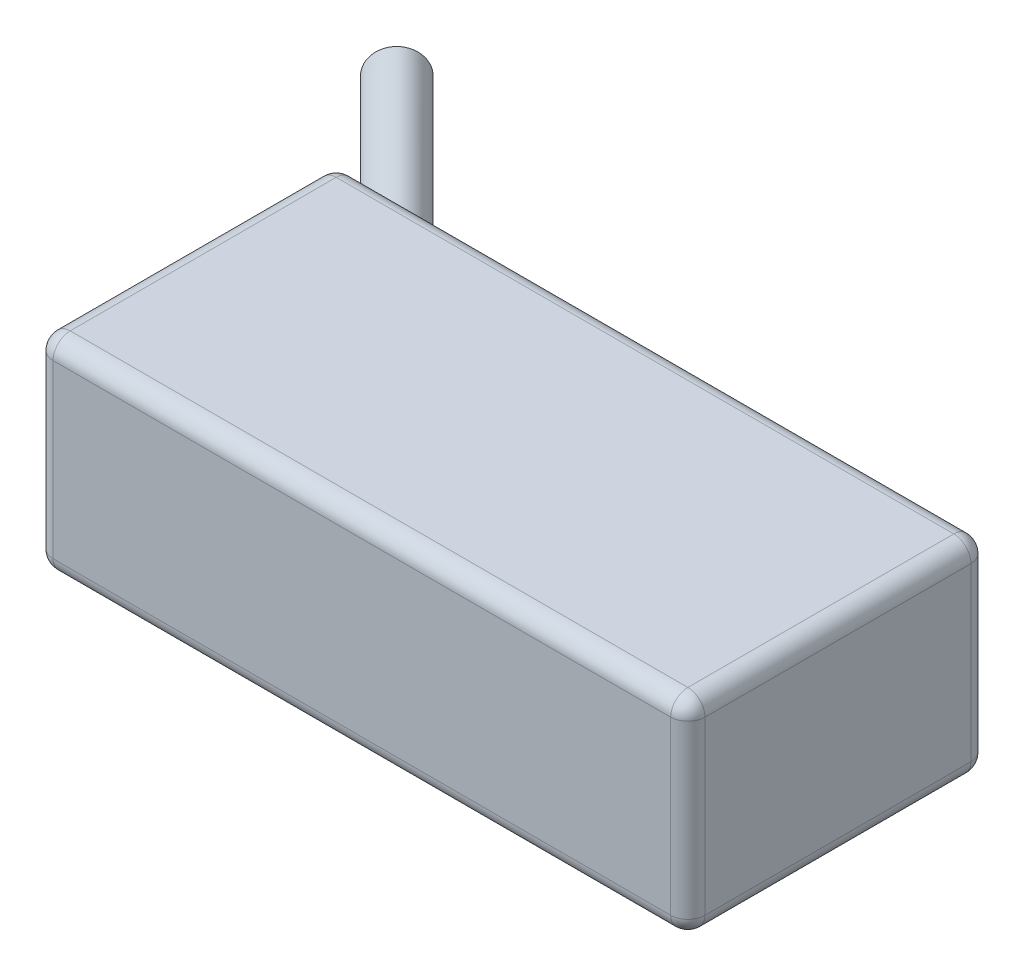
ISO-10303-21;
HEADER;
FILE_DESCRIPTION(('STEP AP214'),'2;1');
FILE_NAME('part.step','',(''),(''),'','','');
FILE_SCHEMA(('AUTOMOTIVE_DESIGN { 1 0 10303 214 1 1 1 1 }'));
ENDSEC;
DATA;
#1=APPLICATION_CONTEXT('core data for automotive mechanical design processes');
#2=APPLICATION_PROTOCOL_DEFINITION('international standard','automotive_design',2000,#1);
#3=PRODUCT_CONTEXT('',#1,'mechanical');
#4=PRODUCT('Part','Part','',(#3));
#5=PRODUCT_RELATED_PRODUCT_CATEGORY('part','',(#4));
#6=PRODUCT_DEFINITION_FORMATION('','',#4);
#7=PRODUCT_DEFINITION_CONTEXT('part definition',#1,'design');
#8=PRODUCT_DEFINITION('design','',#6,#7);
#9=PRODUCT_DEFINITION_SHAPE('','',#8);
#10=(LENGTH_UNIT() NAMED_UNIT(*) SI_UNIT(.MILLI.,.METRE.));
#11=(NAMED_UNIT(*) PLANE_ANGLE_UNIT() SI_UNIT($,.RADIAN.));
#12=(NAMED_UNIT(*) SI_UNIT($,.STERADIAN.) SOLID_ANGLE_UNIT());
#13=UNCERTAINTY_MEASURE_WITH_UNIT(LENGTH_MEASURE(1.E-05),#10,'distance_accuracy_value','');
#14=(GEOMETRIC_REPRESENTATION_CONTEXT(3) GLOBAL_UNCERTAINTY_ASSIGNED_CONTEXT((#13)) GLOBAL_UNIT_ASSIGNED_CONTEXT((#10,
#11,#12)) REPRESENTATION_CONTEXT('',''));
#15=CARTESIAN_POINT('',(0.,0.,0.));
#16=DIRECTION('',(0.,0.,1.));
#17=DIRECTION('',(1.,0.,0.));
#18=AXIS2_PLACEMENT_3D('',#15,#16,#17);
#19=CARTESIAN_POINT('',(38.,12.,-17.5));
#20=DIRECTION('',(-1.,0.,0.));
#21=DIRECTION('',(0.,0.,1.));
#22=AXIS2_PLACEMENT_3D('',#19,#20,#21);
#23=PLANE('',#22);
#24=DIRECTION('',(0.,-1.,0.));
#25=VECTOR('',#24,1.);
#26=CARTESIAN_POINT('',(38.,12.,15.5));
#27=LINE('',#26,#25);
#28=CARTESIAN_POINT('',(38.,10.,15.5));
#29=VERTEX_POINT('',#28);
#30=CARTESIAN_POINT('',(38.,-10.,15.5));
#31=VERTEX_POINT('',#30);
#32=EDGE_CURVE('E177',#29,#31,#27,.T.);
#33=ORIENTED_EDGE('',*,*,#32,.T.);
#34=DIRECTION('',(0.,0.,-1.));
#35=VECTOR('',#34,1.);
#36=CARTESIAN_POINT('',(38.,-10.,-17.5));
#37=LINE('',#36,#35);
#38=CARTESIAN_POINT('',(38.,-10.,-15.5));
#39=VERTEX_POINT('',#38);
#40=EDGE_CURVE('E184',#31,#39,#37,.T.);
#41=ORIENTED_EDGE('',*,*,#40,.T.);
#42=DIRECTION('',(0.,-1.,0.));
#43=VECTOR('',#42,1.);
#44=CARTESIAN_POINT('',(38.,12.,-15.5));
#45=LINE('',#44,#43);
#46=CARTESIAN_POINT('',(38.,10.,-15.5));
#47=VERTEX_POINT('',#46);
#48=EDGE_CURVE('E180',#39,#47,#45,.F.);
#49=ORIENTED_EDGE('',*,*,#48,.T.);
#50=DIRECTION('',(0.,0.,-1.));
#51=VECTOR('',#50,1.);
#52=CARTESIAN_POINT('',(38.,10.,17.5));
#53=LINE('',#52,#51);
#54=EDGE_CURVE('E174',#47,#29,#53,.F.);
#55=ORIENTED_EDGE('',*,*,#54,.T.);
#56=EDGE_LOOP('',(#33,#41,#49,#55));
#57=FACE_BOUND('',#56,.T.);
#58=ADVANCED_FACE('F39',(#57),#23,.F.);
#59=CARTESIAN_POINT('',(-38.,12.,-17.5));
#60=DIRECTION('',(0.,0.,1.));
#61=DIRECTION('',(1.,0.,0.));
#62=AXIS2_PLACEMENT_3D('',#59,#60,#61);
#63=PLANE('',#62);
#64=DIRECTION('',(0.,-1.,0.));
#65=VECTOR('',#64,1.);
#66=CARTESIAN_POINT('',(36.,12.,-17.5));
#67=LINE('',#66,#65);
#68=CARTESIAN_POINT('',(36.,10.,-17.5));
#69=VERTEX_POINT('',#68);
#70=CARTESIAN_POINT('',(36.,-10.,-17.5));
#71=VERTEX_POINT('',#70);
#72=EDGE_CURVE('E167',#69,#71,#67,.T.);
#73=ORIENTED_EDGE('',*,*,#72,.T.);
#74=DIRECTION('',(-1.,0.,0.));
#75=VECTOR('',#74,1.);
#76=CARTESIAN_POINT('',(-38.,-10.,-17.5));
#77=LINE('',#76,#75);
#78=CARTESIAN_POINT('',(-36.,-10.,-17.5));
#79=VERTEX_POINT('',#78);
#80=EDGE_CURVE('E171',#71,#79,#77,.T.);
#81=ORIENTED_EDGE('',*,*,#80,.T.);
#82=DIRECTION('',(0.,-1.,0.));
#83=VECTOR('',#82,1.);
#84=CARTESIAN_POINT('',(-36.,12.,-17.5));
#85=LINE('',#84,#83);
#86=CARTESIAN_POINT('',(-36.,10.,-17.5));
#87=VERTEX_POINT('',#86);
#88=EDGE_CURVE('E161',#79,#87,#85,.F.);
#89=ORIENTED_EDGE('',*,*,#88,.T.);
#90=DIRECTION('',(-1.,0.,0.));
#91=VECTOR('',#90,1.);
#92=CARTESIAN_POINT('',(38.,10.,-17.5));
#93=LINE('',#92,#91);
#94=EDGE_CURVE('E158',#87,#69,#93,.F.);
#95=ORIENTED_EDGE('',*,*,#94,.T.);
#96=EDGE_LOOP('',(#73,#81,#89,#95));
#97=FACE_BOUND('',#96,.T.);
#98=DIRECTION('',(0.,1.,0.));
#99=VECTOR('',#98,1.);
#100=CARTESIAN_POINT('',(-27.9999999999999,12.,-17.5));
#101=LINE('',#100,#99);
#102=CARTESIAN_POINT('',(-27.9999999999999,-6.17040966608938,-17.5));
#103=VERTEX_POINT('',#102);
#104=CARTESIAN_POINT('',(-27.9999999999999,-1.82959033391062,-17.5));
#105=VERTEX_POINT('',#104);
#106=EDGE_CURVE('E139',#103,#105,#101,.T.);
#107=ORIENTED_EDGE('',*,*,#106,.T.);
#108=CARTESIAN_POINT('',(-30.9289321881345,-4.,-17.5));
#109=DIRECTION('',(0.,0.,1.));
#110=DIRECTION('',(1.,0.,0.));
#111=AXIS2_PLACEMENT_3D('',#108,#109,#110);
#112=ELLIPSE('',#111,4.24264068711925,2.99999999999999);
#113=EDGE_CURVE('E147',#105,#103,#112,.T.);
#114=ORIENTED_EDGE('',*,*,#113,.T.);
#115=EDGE_LOOP('',(#107,#114));
#116=FACE_BOUND('',#115,.T.);
#117=DIRECTION('',(0.,1.,0.));
#118=VECTOR('',#117,1.);
#119=CARTESIAN_POINT('',(-27.9999999999999,12.,-17.5));
#120=LINE('',#119,#118);
#121=CARTESIAN_POINT('',(-27.9999999999999,1.8295903339106,-17.5));
#122=VERTEX_POINT('',#121);
#123=CARTESIAN_POINT('',(-27.9999999999999,6.1704096660894,-17.5));
#124=VERTEX_POINT('',#123);
#125=EDGE_CURVE('E682',#122,#124,#120,.T.);
#126=ORIENTED_EDGE('',*,*,#125,.T.);
#127=CARTESIAN_POINT('',(-30.9289321881345,4.,-17.5));
#128=DIRECTION('',(0.,0.,1.));
#129=DIRECTION('',(1.,0.,0.));
#130=AXIS2_PLACEMENT_3D('',#127,#128,#129);
#131=ELLIPSE('',#130,4.24264068711927,3.);
#132=EDGE_CURVE('E148',#124,#122,#131,.T.);
#133=ORIENTED_EDGE('',*,*,#132,.T.);
#134=EDGE_LOOP('',(#126,#133));
#135=FACE_BOUND('',#134,.T.);
#136=ADVANCED_FACE('F155',(#97,#116,#135),#63,.F.);
#137=CARTESIAN_POINT('',(-38.,12.,-17.5));
#138=DIRECTION('',(1.,0.,0.));
#139=DIRECTION('',(0.,0.,-1.));
#140=AXIS2_PLACEMENT_3D('',#137,#138,#139);
#141=PLANE('',#140);
#142=DIRECTION('',(0.,-1.,0.));
#143=VECTOR('',#142,1.);
#144=CARTESIAN_POINT('',(-38.,12.,-15.5));
#145=LINE('',#144,#143);
#146=CARTESIAN_POINT('',(-38.,10.,-15.5));
#147=VERTEX_POINT('',#146);
#148=CARTESIAN_POINT('',(-38.,-10.,-15.5));
#149=VERTEX_POINT('',#148);
#150=EDGE_CURVE('E193',#147,#149,#145,.T.);
#151=ORIENTED_EDGE('',*,*,#150,.T.);
#152=DIRECTION('',(0.,0.,1.));
#153=VECTOR('',#152,1.);
#154=CARTESIAN_POINT('',(-38.,-10.,-17.5));
#155=LINE('',#154,#153);
#156=CARTESIAN_POINT('',(-38.,-10.,15.5));
#157=VERTEX_POINT('',#156);
#158=EDGE_CURVE('E197',#149,#157,#155,.T.);
#159=ORIENTED_EDGE('',*,*,#158,.T.);
#160=DIRECTION('',(0.,-1.,0.));
#161=VECTOR('',#160,1.);
#162=CARTESIAN_POINT('',(-38.,12.,15.5));
#163=LINE('',#162,#161);
#164=CARTESIAN_POINT('',(-38.,10.,15.5));
#165=VERTEX_POINT('',#164);
#166=EDGE_CURVE('E190',#157,#165,#163,.F.);
#167=ORIENTED_EDGE('',*,*,#166,.T.);
#168=DIRECTION('',(0.,0.,1.));
#169=VECTOR('',#168,1.);
#170=CARTESIAN_POINT('',(-38.,10.,-17.5));
#171=LINE('',#170,#169);
#172=EDGE_CURVE('E187',#165,#147,#171,.F.);
#173=ORIENTED_EDGE('',*,*,#172,.T.);
#174=EDGE_LOOP('',(#151,#159,#167,#173));
#175=FACE_BOUND('',#174,.T.);
#176=ADVANCED_FACE('F372',(#175),#141,.F.);
#177=CARTESIAN_POINT('',(-38.,12.,17.5));
#178=DIRECTION('',(0.,0.,-1.));
#179=DIRECTION('',(-1.,0.,0.));
#180=AXIS2_PLACEMENT_3D('',#177,#178,#179);
#181=PLANE('',#180);
#182=DIRECTION('',(0.,-1.,0.));
#183=VECTOR('',#182,1.);
#184=CARTESIAN_POINT('',(-36.,12.,17.5));
#185=LINE('',#184,#183);
#186=CARTESIAN_POINT('',(-36.,10.,17.5));
#187=VERTEX_POINT('',#186);
#188=CARTESIAN_POINT('',(-36.,-10.,17.5));
#189=VERTEX_POINT('',#188);
#190=EDGE_CURVE('E206',#187,#189,#185,.T.);
#191=ORIENTED_EDGE('',*,*,#190,.T.);
#192=DIRECTION('',(1.,0.,0.));
#193=VECTOR('',#192,1.);
#194=CARTESIAN_POINT('',(-38.,-10.,17.5));
#195=LINE('',#194,#193);
#196=CARTESIAN_POINT('',(36.,-10.,17.5));
#197=VERTEX_POINT('',#196);
#198=EDGE_CURVE('E210',#189,#197,#195,.T.);
#199=ORIENTED_EDGE('',*,*,#198,.T.);
#200=DIRECTION('',(0.,-1.,0.));
#201=VECTOR('',#200,1.);
#202=CARTESIAN_POINT('',(36.,12.,17.5));
#203=LINE('',#202,#201);
#204=CARTESIAN_POINT('',(36.,10.,17.5));
#205=VERTEX_POINT('',#204);
#206=EDGE_CURVE('E203',#197,#205,#203,.F.);
#207=ORIENTED_EDGE('',*,*,#206,.T.);
#208=DIRECTION('',(1.,0.,0.));
#209=VECTOR('',#208,1.);
#210=CARTESIAN_POINT('',(-38.,10.,17.5));
#211=LINE('',#210,#209);
#212=EDGE_CURVE('E200',#205,#187,#211,.F.);
#213=ORIENTED_EDGE('',*,*,#212,.T.);
#214=EDGE_LOOP('',(#191,#199,#207,#213));
#215=FACE_BOUND('',#214,.T.);
#216=ADVANCED_FACE('F375',(#215),#181,.F.);
#217=CARTESIAN_POINT('',(0.,12.,0.));
#218=DIRECTION('',(0.,1.,0.));
#219=DIRECTION('',(0.,0.,1.));
#220=AXIS2_PLACEMENT_3D('',#217,#218,#219);
#221=PLANE('',#220);
#222=DIRECTION('',(0.,0.,1.));
#223=VECTOR('',#222,1.);
#224=CARTESIAN_POINT('',(-36.,12.,17.5));
#225=LINE('',#224,#223);
#226=CARTESIAN_POINT('',(-36.,12.,-15.5));
#227=VERTEX_POINT('',#226);
#228=CARTESIAN_POINT('',(-36.,12.,15.5));
#229=VERTEX_POINT('',#228);
#230=EDGE_CURVE('E49',#227,#229,#225,.T.);
#231=ORIENTED_EDGE('',*,*,#230,.T.);
#232=DIRECTION('',(1.,0.,0.));
#233=VECTOR('',#232,1.);
#234=CARTESIAN_POINT('',(38.,12.,15.5));
#235=LINE('',#234,#233);
#236=CARTESIAN_POINT('',(36.,12.,15.5));
#237=VERTEX_POINT('',#236);
#238=EDGE_CURVE('E11',#229,#237,#235,.T.);
#239=ORIENTED_EDGE('',*,*,#238,.T.);
#240=DIRECTION('',(0.,0.,-1.));
#241=VECTOR('',#240,1.);
#242=CARTESIAN_POINT('',(36.,12.,-17.5));
#243=LINE('',#242,#241);
#244=CARTESIAN_POINT('',(36.,12.,-15.5));
#245=VERTEX_POINT('',#244);
#246=EDGE_CURVE('E226',#237,#245,#243,.T.);
#247=ORIENTED_EDGE('',*,*,#246,.T.);
#248=DIRECTION('',(-1.,0.,0.));
#249=VECTOR('',#248,1.);
#250=CARTESIAN_POINT('',(-38.,12.,-15.5));
#251=LINE('',#250,#249);
#252=EDGE_CURVE('E60',#245,#227,#251,.T.);
#253=ORIENTED_EDGE('',*,*,#252,.T.);
#254=EDGE_LOOP('',(#231,#239,#247,#253));
#255=FACE_BOUND('',#254,.T.);
#256=ADVANCED_FACE('F339',(#255),#221,.T.);
#257=CARTESIAN_POINT('',(0.,-12.,0.));
#258=DIRECTION('',(0.,1.,0.));
#259=DIRECTION('',(0.,0.,1.));
#260=AXIS2_PLACEMENT_3D('',#257,#258,#259);
#261=PLANE('',#260);
#262=DIRECTION('',(0.,0.,1.));
#263=VECTOR('',#262,1.);
#264=CARTESIAN_POINT('',(-36.,-12.,0.));
#265=LINE('',#264,#263);
#266=CARTESIAN_POINT('',(-36.,-12.,15.5));
#267=VERTEX_POINT('',#266);
#268=CARTESIAN_POINT('',(-36.,-12.,-15.5));
#269=VERTEX_POINT('',#268);
#270=EDGE_CURVE('E219',#267,#269,#265,.F.);
#271=ORIENTED_EDGE('',*,*,#270,.T.);
#272=DIRECTION('',(-1.,0.,0.));
#273=VECTOR('',#272,1.);
#274=CARTESIAN_POINT('',(0.,-12.,-15.5));
#275=LINE('',#274,#273);
#276=CARTESIAN_POINT('',(36.,-12.,-15.5));
#277=VERTEX_POINT('',#276);
#278=EDGE_CURVE('E222',#269,#277,#275,.F.);
#279=ORIENTED_EDGE('',*,*,#278,.T.);
#280=DIRECTION('',(0.,0.,-1.));
#281=VECTOR('',#280,1.);
#282=CARTESIAN_POINT('',(36.,-12.,0.));
#283=LINE('',#282,#281);
#284=CARTESIAN_POINT('',(36.,-12.,15.5));
#285=VERTEX_POINT('',#284);
#286=EDGE_CURVE('E213',#277,#285,#283,.F.);
#287=ORIENTED_EDGE('',*,*,#286,.T.);
#288=DIRECTION('',(1.,0.,0.));
#289=VECTOR('',#288,1.);
#290=CARTESIAN_POINT('',(0.,-12.,15.5));
#291=LINE('',#290,#289);
#292=EDGE_CURVE('E216',#285,#267,#291,.F.);
#293=ORIENTED_EDGE('',*,*,#292,.T.);
#294=EDGE_LOOP('',(#271,#279,#287,#293));
#295=FACE_BOUND('',#294,.T.);
#296=ADVANCED_FACE('F619',(#295),#261,.F.);
#297=CARTESIAN_POINT('',(-50.6776695296635,4.,-37.2487373415292));
#298=DIRECTION('',(0.707106781186544,0.,0.707106781186551));
#299=DIRECTION('',(0.707106781186551,0.,-0.707106781186544));
#300=AXIS2_PLACEMENT_3D('',#297,#298,#299);
#301=CYLINDRICAL_SURFACE('',#300,3.);
#302=CARTESIAN_POINT('',(-50.6776695296635,4.,-37.2487373415292));
#303=DIRECTION('',(0.707106781186544,0.,0.707106781186551));
#304=DIRECTION('',(0.707106781186551,0.,-0.707106781186544));
#305=AXIS2_PLACEMENT_3D('',#302,#303,#304);
#306=CIRCLE('',#305,3.);
#307=CARTESIAN_POINT('',(-48.5563491861039,4.,-39.3700576850888));
#308=VERTEX_POINT('',#307);
#309=EDGE_CURVE('E675',#308,#308,#306,.T.);
#310=ORIENTED_EDGE('',*,*,#309,.T.);
#311=EDGE_LOOP('',(#310));
#312=FACE_BOUND('',#311,.T.);
#313=ORIENTED_EDGE('',*,*,#132,.F.);
#314=CARTESIAN_POINT('',(-29.4644660940672,4.,-16.0355339059326));
#315=DIRECTION('',(0.707106781186544,0.,0.707106781186551));
#316=DIRECTION('',(0.707106781186551,0.,-0.707106781186544));
#317=AXIS2_PLACEMENT_3D('',#314,#315,#316);
#318=CIRCLE('',#317,3.);
#319=EDGE_CURVE('E680',#122,#124,#318,.T.);
#320=ORIENTED_EDGE('',*,*,#319,.F.);
#321=EDGE_LOOP('',(#313,#320));
#322=FACE_BOUND('',#321,.T.);
#323=ADVANCED_FACE('F610',(#312,#322),#301,.T.);
#324=CARTESIAN_POINT('',(-29.4644660940672,4.,-16.0355339059326));
#325=DIRECTION('',(0.707106781186544,0.,0.707106781186551));
#326=DIRECTION('',(0.707106781186551,0.,-0.707106781186544));
#327=AXIS2_PLACEMENT_3D('',#324,#325,#326);
#328=PLANE('',#327);
#329=ORIENTED_EDGE('',*,*,#125,.F.);
#330=ORIENTED_EDGE('',*,*,#319,.T.);
#331=EDGE_LOOP('',(#329,#330));
#332=FACE_BOUND('',#331,.T.);
#333=ADVANCED_FACE('F601',(#332),#328,.T.);
#334=CARTESIAN_POINT('',(-50.6776695296635,4.,-37.2487373415292));
#335=DIRECTION('',(0.707106781186544,0.,0.707106781186551));
#336=DIRECTION('',(0.707106781186551,0.,-0.707106781186544));
#337=AXIS2_PLACEMENT_3D('',#334,#335,#336);
#338=PLANE('',#337);
#339=ORIENTED_EDGE('',*,*,#309,.F.);
#340=EDGE_LOOP('',(#339));
#341=FACE_BOUND('',#340,.T.);
#342=ADVANCED_FACE('F592',(#341),#338,.F.);
#343=CARTESIAN_POINT('',(-50.6776695296635,-4.,-37.2487373415292));
#344=DIRECTION('',(0.707106781186544,0.,0.707106781186551));
#345=DIRECTION('',(0.707106781186551,0.,-0.707106781186544));
#346=AXIS2_PLACEMENT_3D('',#343,#344,#345);
#347=CYLINDRICAL_SURFACE('',#346,2.99999999999999);
#348=CARTESIAN_POINT('',(-50.6776695296635,-4.,-37.2487373415292));
#349=DIRECTION('',(0.707106781186544,0.,0.707106781186551));
#350=DIRECTION('',(0.707106781186551,0.,-0.707106781186544));
#351=AXIS2_PLACEMENT_3D('',#348,#349,#350);
#352=CIRCLE('',#351,2.99999999999999);
#353=CARTESIAN_POINT('',(-48.5563491861039,-4.,-39.3700576850888));
#354=VERTEX_POINT('',#353);
#355=EDGE_CURVE('E153',#354,#354,#352,.T.);
#356=ORIENTED_EDGE('',*,*,#355,.T.);
#357=EDGE_LOOP('',(#356));
#358=FACE_BOUND('',#357,.T.);
#359=ORIENTED_EDGE('',*,*,#113,.F.);
#360=CARTESIAN_POINT('',(-29.4644660940672,-4.,-16.0355339059326));
#361=DIRECTION('',(0.707106781186544,0.,0.707106781186551));
#362=DIRECTION('',(0.707106781186551,0.,-0.707106781186544));
#363=AXIS2_PLACEMENT_3D('',#360,#361,#362);
#364=CIRCLE('',#363,2.99999999999999);
#365=EDGE_CURVE('E142',#103,#105,#364,.T.);
#366=ORIENTED_EDGE('',*,*,#365,.F.);
#367=EDGE_LOOP('',(#359,#366));
#368=FACE_BOUND('',#367,.T.);
#369=ADVANCED_FACE('F151',(#358,#368),#347,.T.);
#370=CARTESIAN_POINT('',(-29.4644660940672,-4.,-16.0355339059326));
#371=DIRECTION('',(0.707106781186544,0.,0.707106781186551));
#372=DIRECTION('',(0.707106781186551,0.,-0.707106781186544));
#373=AXIS2_PLACEMENT_3D('',#370,#371,#372);
#374=PLANE('',#373);
#375=ORIENTED_EDGE('',*,*,#106,.F.);
#376=ORIENTED_EDGE('',*,*,#365,.T.);
#377=EDGE_LOOP('',(#375,#376));
#378=FACE_BOUND('',#377,.T.);
#379=ADVANCED_FACE('F141',(#378),#374,.T.);
#380=CARTESIAN_POINT('',(-50.6776695296635,-4.,-37.2487373415292));
#381=DIRECTION('',(0.707106781186544,0.,0.707106781186551));
#382=DIRECTION('',(0.707106781186551,0.,-0.707106781186544));
#383=AXIS2_PLACEMENT_3D('',#380,#381,#382);
#384=PLANE('',#383);
#385=ORIENTED_EDGE('',*,*,#355,.F.);
#386=EDGE_LOOP('',(#385));
#387=FACE_BOUND('',#386,.T.);
#388=ADVANCED_FACE('F569',(#387),#384,.F.);
#389=CARTESIAN_POINT('',(-36.,12.,15.5));
#390=DIRECTION('',(0.,-1.,0.));
#391=DIRECTION('',(0.,0.,-1.));
#392=AXIS2_PLACEMENT_3D('',#389,#390,#391);
#393=CYLINDRICAL_SURFACE('',#392,2.);
#394=CARTESIAN_POINT('',(-36.,10.,15.5));
#395=DIRECTION('',(0.,1.,0.));
#396=DIRECTION('',(0.,0.,1.));
#397=AXIS2_PLACEMENT_3D('',#394,#395,#396);
#398=CIRCLE('',#397,2.);
#399=EDGE_CURVE('E43',#165,#187,#398,.T.);
#400=ORIENTED_EDGE('',*,*,#399,.F.);
#401=ORIENTED_EDGE('',*,*,#166,.F.);
#402=CARTESIAN_POINT('',(-36.,-10.,15.5));
#403=DIRECTION('',(0.,-1.,0.));
#404=DIRECTION('',(0.,0.,-1.));
#405=AXIS2_PLACEMENT_3D('',#402,#403,#404);
#406=CIRCLE('',#405,2.);
#407=EDGE_CURVE('E315',#189,#157,#406,.T.);
#408=ORIENTED_EDGE('',*,*,#407,.F.);
#409=ORIENTED_EDGE('',*,*,#190,.F.);
#410=EDGE_LOOP('',(#400,#401,#408,#409));
#411=FACE_BOUND('',#410,.T.);
#412=ADVANCED_FACE('F41',(#411),#393,.T.);
#413=CARTESIAN_POINT('',(-36.,10.,15.5));
#414=DIRECTION('',(0.,0.,1.));
#415=DIRECTION('',(1.,0.,0.));
#416=AXIS2_PLACEMENT_3D('',#413,#414,#415);
#417=SPHERICAL_SURFACE('',#416,2.);
#418=CARTESIAN_POINT('',(-36.,10.,15.5));
#419=DIRECTION('',(0.,0.,1.));
#420=DIRECTION('',(1.,0.,0.));
#421=AXIS2_PLACEMENT_3D('',#418,#419,#420);
#422=CIRCLE('',#421,2.);
#423=EDGE_CURVE('E309',#165,#229,#422,.F.);
#424=ORIENTED_EDGE('',*,*,#423,.F.);
#425=ORIENTED_EDGE('',*,*,#399,.T.);
#426=CARTESIAN_POINT('',(-36.,10.,15.5));
#427=DIRECTION('',(-1.,0.,0.));
#428=DIRECTION('',(0.,0.,1.));
#429=AXIS2_PLACEMENT_3D('',#426,#427,#428);
#430=CIRCLE('',#429,2.);
#431=EDGE_CURVE('E312',#229,#187,#430,.F.);
#432=ORIENTED_EDGE('',*,*,#431,.F.);
#433=EDGE_LOOP('',(#424,#425,#432));
#434=FACE_BOUND('',#433,.T.);
#435=ADVANCED_FACE('F328',(#434),#417,.T.);
#436=CARTESIAN_POINT('',(-36.,-10.,15.5));
#437=DIRECTION('',(-1.,0.,0.));
#438=DIRECTION('',(0.,-1.,0.));
#439=AXIS2_PLACEMENT_3D('',#436,#437,#438);
#440=SPHERICAL_SURFACE('',#439,2.);
#441=CARTESIAN_POINT('',(-36.,-10.,15.5));
#442=DIRECTION('',(-1.,0.,0.));
#443=DIRECTION('',(0.,0.,1.));
#444=AXIS2_PLACEMENT_3D('',#441,#442,#443);
#445=CIRCLE('',#444,2.);
#446=EDGE_CURVE('E301',#189,#267,#445,.F.);
#447=ORIENTED_EDGE('',*,*,#446,.F.);
#448=ORIENTED_EDGE('',*,*,#407,.T.);
#449=CARTESIAN_POINT('',(-36.,-10.,15.5));
#450=DIRECTION('',(0.,0.,1.));
#451=DIRECTION('',(1.,0.,0.));
#452=AXIS2_PLACEMENT_3D('',#449,#450,#451);
#453=CIRCLE('',#452,2.);
#454=EDGE_CURVE('E305',#267,#157,#453,.F.);
#455=ORIENTED_EDGE('',*,*,#454,.F.);
#456=EDGE_LOOP('',(#447,#448,#455));
#457=FACE_BOUND('',#456,.T.);
#458=ADVANCED_FACE('F443',(#457),#440,.T.);
#459=CARTESIAN_POINT('',(0.,10.,15.5));
#460=DIRECTION('',(-1.,0.,0.));
#461=DIRECTION('',(0.,0.,1.));
#462=AXIS2_PLACEMENT_3D('',#459,#460,#461);
#463=CYLINDRICAL_SURFACE('',#462,2.);
#464=ORIENTED_EDGE('',*,*,#431,.T.);
#465=ORIENTED_EDGE('',*,*,#212,.F.);
#466=CARTESIAN_POINT('',(36.,10.,15.5));
#467=DIRECTION('',(1.,0.,0.));
#468=DIRECTION('',(0.,0.,-1.));
#469=AXIS2_PLACEMENT_3D('',#466,#467,#468);
#470=CIRCLE('',#469,2.);
#471=EDGE_CURVE('E293',#237,#205,#470,.T.);
#472=ORIENTED_EDGE('',*,*,#471,.F.);
#473=ORIENTED_EDGE('',*,*,#238,.F.);
#474=EDGE_LOOP('',(#464,#465,#472,#473));
#475=FACE_BOUND('',#474,.T.);
#476=ADVANCED_FACE('F336',(#475),#463,.T.);
#477=CARTESIAN_POINT('',(-36.,10.,0.));
#478=DIRECTION('',(0.,0.,-1.));
#479=DIRECTION('',(-1.,0.,0.));
#480=AXIS2_PLACEMENT_3D('',#477,#478,#479);
#481=CYLINDRICAL_SURFACE('',#480,2.);
#482=ORIENTED_EDGE('',*,*,#423,.T.);
#483=ORIENTED_EDGE('',*,*,#230,.F.);
#484=CARTESIAN_POINT('',(-36.,10.,-15.5));
#485=DIRECTION('',(0.,0.,-1.));
#486=DIRECTION('',(-1.,0.,0.));
#487=AXIS2_PLACEMENT_3D('',#484,#485,#486);
#488=CIRCLE('',#487,2.);
#489=EDGE_CURVE('E289',#147,#227,#488,.T.);
#490=ORIENTED_EDGE('',*,*,#489,.F.);
#491=ORIENTED_EDGE('',*,*,#172,.F.);
#492=EDGE_LOOP('',(#482,#483,#490,#491));
#493=FACE_BOUND('',#492,.T.);
#494=ADVANCED_FACE('F370',(#493),#481,.T.);
#495=CARTESIAN_POINT('',(-36.,12.,-15.5));
#496=DIRECTION('',(0.,-1.,0.));
#497=DIRECTION('',(0.,0.,-1.));
#498=AXIS2_PLACEMENT_3D('',#495,#496,#497);
#499=CYLINDRICAL_SURFACE('',#498,2.);
#500=CARTESIAN_POINT('',(-36.,-10.,-15.5));
#501=DIRECTION('',(0.,-1.,0.));
#502=DIRECTION('',(0.,0.,-1.));
#503=AXIS2_PLACEMENT_3D('',#500,#501,#502);
#504=CIRCLE('',#503,2.);
#505=EDGE_CURVE('E281',#149,#79,#504,.T.);
#506=ORIENTED_EDGE('',*,*,#505,.F.);
#507=ORIENTED_EDGE('',*,*,#150,.F.);
#508=CARTESIAN_POINT('',(-36.,10.,-15.5));
#509=DIRECTION('',(0.,1.,0.));
#510=DIRECTION('',(0.,0.,1.));
#511=AXIS2_PLACEMENT_3D('',#508,#509,#510);
#512=CIRCLE('',#511,2.);
#513=EDGE_CURVE('E285',#87,#147,#512,.T.);
#514=ORIENTED_EDGE('',*,*,#513,.F.);
#515=ORIENTED_EDGE('',*,*,#88,.F.);
#516=EDGE_LOOP('',(#506,#507,#514,#515));
#517=FACE_BOUND('',#516,.T.);
#518=ADVANCED_FACE('F365',(#517),#499,.T.);
#519=CARTESIAN_POINT('',(-36.,-10.,-17.5));
#520=DIRECTION('',(0.,0.,1.));
#521=DIRECTION('',(1.,0.,0.));
#522=AXIS2_PLACEMENT_3D('',#519,#520,#521);
#523=CYLINDRICAL_SURFACE('',#522,2.);
#524=ORIENTED_EDGE('',*,*,#454,.T.);
#525=ORIENTED_EDGE('',*,*,#158,.F.);
#526=CARTESIAN_POINT('',(-36.,-10.,-15.5));
#527=DIRECTION('',(0.,0.,-1.));
#528=DIRECTION('',(-1.,0.,0.));
#529=AXIS2_PLACEMENT_3D('',#526,#527,#528);
#530=CIRCLE('',#529,2.);
#531=EDGE_CURVE('E278',#269,#149,#530,.T.);
#532=ORIENTED_EDGE('',*,*,#531,.F.);
#533=ORIENTED_EDGE('',*,*,#270,.F.);
#534=EDGE_LOOP('',(#524,#525,#532,#533));
#535=FACE_BOUND('',#534,.T.);
#536=ADVANCED_FACE('F442',(#535),#523,.T.);
#537=CARTESIAN_POINT('',(-38.,-10.,15.5));
#538=DIRECTION('',(1.,0.,0.));
#539=DIRECTION('',(0.,0.,-1.));
#540=AXIS2_PLACEMENT_3D('',#537,#538,#539);
#541=CYLINDRICAL_SURFACE('',#540,2.);
#542=ORIENTED_EDGE('',*,*,#446,.T.);
#543=ORIENTED_EDGE('',*,*,#292,.F.);
#544=CARTESIAN_POINT('',(36.,-10.,15.5));
#545=DIRECTION('',(1.,0.,0.));
#546=DIRECTION('',(0.,0.,-1.));
#547=AXIS2_PLACEMENT_3D('',#544,#545,#546);
#548=CIRCLE('',#547,2.);
#549=EDGE_CURVE('E274',#197,#285,#548,.T.);
#550=ORIENTED_EDGE('',*,*,#549,.F.);
#551=ORIENTED_EDGE('',*,*,#198,.F.);
#552=EDGE_LOOP('',(#542,#543,#550,#551));
#553=FACE_BOUND('',#552,.T.);
#554=ADVANCED_FACE('F385',(#553),#541,.T.);
#555=CARTESIAN_POINT('',(36.,12.,15.5));
#556=DIRECTION('',(0.,-1.,0.));
#557=DIRECTION('',(0.,0.,-1.));
#558=AXIS2_PLACEMENT_3D('',#555,#556,#557);
#559=CYLINDRICAL_SURFACE('',#558,2.);
#560=CARTESIAN_POINT('',(36.,10.,15.5));
#561=DIRECTION('',(0.,1.,0.));
#562=DIRECTION('',(0.,0.,1.));
#563=AXIS2_PLACEMENT_3D('',#560,#561,#562);
#564=CIRCLE('',#563,2.);
#565=EDGE_CURVE('E297',#205,#29,#564,.T.);
#566=ORIENTED_EDGE('',*,*,#565,.F.);
#567=ORIENTED_EDGE('',*,*,#206,.F.);
#568=CARTESIAN_POINT('',(36.,-10.,15.5));
#569=DIRECTION('',(0.,-1.,0.));
#570=DIRECTION('',(0.,0.,-1.));
#571=AXIS2_PLACEMENT_3D('',#568,#569,#570);
#572=CIRCLE('',#571,2.);
#573=EDGE_CURVE('E270',#31,#197,#572,.T.);
#574=ORIENTED_EDGE('',*,*,#573,.F.);
#575=ORIENTED_EDGE('',*,*,#32,.F.);
#576=EDGE_LOOP('',(#566,#567,#574,#575));
#577=FACE_BOUND('',#576,.T.);
#578=ADVANCED_FACE('F380',(#577),#559,.T.);
#579=CARTESIAN_POINT('',(36.,10.,15.5));
#580=DIRECTION('',(0.,0.,1.));
#581=DIRECTION('',(1.,0.,0.));
#582=AXIS2_PLACEMENT_3D('',#579,#580,#581);
#583=SPHERICAL_SURFACE('',#582,2.);
#584=ORIENTED_EDGE('',*,*,#471,.T.);
#585=ORIENTED_EDGE('',*,*,#565,.T.);
#586=CARTESIAN_POINT('',(36.,10.,15.5));
#587=DIRECTION('',(0.,0.,1.));
#588=DIRECTION('',(0.,-1.,0.));
#589=AXIS2_PLACEMENT_3D('',#586,#587,#588);
#590=CIRCLE('',#589,2.);
#591=EDGE_CURVE('E266',#237,#29,#590,.F.);
#592=ORIENTED_EDGE('',*,*,#591,.F.);
#593=EDGE_LOOP('',(#584,#585,#592));
#594=FACE_BOUND('',#593,.T.);
#595=ADVANCED_FACE('F395',(#594),#583,.T.);
#596=CARTESIAN_POINT('',(-36.,10.,-15.5));
#597=DIRECTION('',(-1.,0.,0.));
#598=DIRECTION('',(0.,0.,1.));
#599=AXIS2_PLACEMENT_3D('',#596,#597,#598);
#600=SPHERICAL_SURFACE('',#599,2.);
#601=ORIENTED_EDGE('',*,*,#513,.T.);
#602=ORIENTED_EDGE('',*,*,#489,.T.);
#603=CARTESIAN_POINT('',(-36.,10.,-15.5));
#604=DIRECTION('',(-1.,0.,0.));
#605=DIRECTION('',(0.,0.,1.));
#606=AXIS2_PLACEMENT_3D('',#603,#604,#605);
#607=CIRCLE('',#606,2.);
#608=EDGE_CURVE('E262',#87,#227,#607,.F.);
#609=ORIENTED_EDGE('',*,*,#608,.F.);
#610=EDGE_LOOP('',(#601,#602,#609));
#611=FACE_BOUND('',#610,.T.);
#612=ADVANCED_FACE('F368',(#611),#600,.T.);
#613=CARTESIAN_POINT('',(-36.,-10.,-15.5));
#614=DIRECTION('',(-1.,0.,0.));
#615=DIRECTION('',(0.,-1.,0.));
#616=AXIS2_PLACEMENT_3D('',#613,#614,#615);
#617=SPHERICAL_SURFACE('',#616,2.);
#618=ORIENTED_EDGE('',*,*,#531,.T.);
#619=ORIENTED_EDGE('',*,*,#505,.T.);
#620=CARTESIAN_POINT('',(-36.,-10.,-15.5));
#621=DIRECTION('',(-1.,0.,0.));
#622=DIRECTION('',(0.,0.,1.));
#623=AXIS2_PLACEMENT_3D('',#620,#621,#622);
#624=CIRCLE('',#623,2.);
#625=EDGE_CURVE('E258',#269,#79,#624,.F.);
#626=ORIENTED_EDGE('',*,*,#625,.F.);
#627=EDGE_LOOP('',(#618,#619,#626));
#628=FACE_BOUND('',#627,.T.);
#629=ADVANCED_FACE('F402',(#628),#617,.T.);
#630=CARTESIAN_POINT('',(36.,-10.,15.5));
#631=DIRECTION('',(0.,0.,1.));
#632=DIRECTION('',(0.,-1.,0.));
#633=AXIS2_PLACEMENT_3D('',#630,#631,#632);
#634=SPHERICAL_SURFACE('',#633,2.);
#635=ORIENTED_EDGE('',*,*,#573,.T.);
#636=ORIENTED_EDGE('',*,*,#549,.T.);
#637=CARTESIAN_POINT('',(36.,-10.,15.5));
#638=DIRECTION('',(0.,0.,1.));
#639=DIRECTION('',(1.,0.,0.));
#640=AXIS2_PLACEMENT_3D('',#637,#638,#639);
#641=CIRCLE('',#640,2.);
#642=EDGE_CURVE('E254',#31,#285,#641,.F.);
#643=ORIENTED_EDGE('',*,*,#642,.F.);
#644=EDGE_LOOP('',(#635,#636,#643));
#645=FACE_BOUND('',#644,.T.);
#646=ADVANCED_FACE('F387',(#645),#634,.T.);
#647=CARTESIAN_POINT('',(36.,10.,0.));
#648=DIRECTION('',(0.,0.,1.));
#649=DIRECTION('',(1.,0.,0.));
#650=AXIS2_PLACEMENT_3D('',#647,#648,#649);
#651=CYLINDRICAL_SURFACE('',#650,2.);
#652=ORIENTED_EDGE('',*,*,#591,.T.);
#653=ORIENTED_EDGE('',*,*,#54,.F.);
#654=CARTESIAN_POINT('',(36.,10.,-15.5));
#655=DIRECTION('',(0.,0.,-1.));
#656=DIRECTION('',(-1.,0.,0.));
#657=AXIS2_PLACEMENT_3D('',#654,#655,#656);
#658=CIRCLE('',#657,2.);
#659=EDGE_CURVE('E250',#245,#47,#658,.T.);
#660=ORIENTED_EDGE('',*,*,#659,.F.);
#661=ORIENTED_EDGE('',*,*,#246,.F.);
#662=EDGE_LOOP('',(#652,#653,#660,#661));
#663=FACE_BOUND('',#662,.T.);
#664=ADVANCED_FACE('F350',(#663),#651,.T.);
#665=CARTESIAN_POINT('',(0.,10.,-15.5));
#666=DIRECTION('',(1.,0.,0.));
#667=DIRECTION('',(0.,0.,-1.));
#668=AXIS2_PLACEMENT_3D('',#665,#666,#667);
#669=CYLINDRICAL_SURFACE('',#668,2.);
#670=ORIENTED_EDGE('',*,*,#608,.T.);
#671=ORIENTED_EDGE('',*,*,#252,.F.);
#672=CARTESIAN_POINT('',(36.,10.,-15.5));
#673=DIRECTION('',(1.,0.,0.));
#674=DIRECTION('',(0.,0.,-1.));
#675=AXIS2_PLACEMENT_3D('',#672,#673,#674);
#676=CIRCLE('',#675,2.);
#677=EDGE_CURVE('E246',#69,#245,#676,.T.);
#678=ORIENTED_EDGE('',*,*,#677,.F.);
#679=ORIENTED_EDGE('',*,*,#94,.F.);
#680=EDGE_LOOP('',(#670,#671,#678,#679));
#681=FACE_BOUND('',#680,.T.);
#682=ADVANCED_FACE('F345',(#681),#669,.T.);
#683=CARTESIAN_POINT('',(-38.,-10.,-15.5));
#684=DIRECTION('',(-1.,0.,0.));
#685=DIRECTION('',(0.,0.,1.));
#686=AXIS2_PLACEMENT_3D('',#683,#684,#685);
#687=CYLINDRICAL_SURFACE('',#686,2.);
#688=ORIENTED_EDGE('',*,*,#625,.T.);
#689=ORIENTED_EDGE('',*,*,#80,.F.);
#690=CARTESIAN_POINT('',(36.,-10.,-15.5));
#691=DIRECTION('',(1.,0.,0.));
#692=DIRECTION('',(0.,0.,-1.));
#693=AXIS2_PLACEMENT_3D('',#690,#691,#692);
#694=CIRCLE('',#693,2.);
#695=EDGE_CURVE('E242',#277,#71,#694,.T.);
#696=ORIENTED_EDGE('',*,*,#695,.F.);
#697=ORIENTED_EDGE('',*,*,#278,.F.);
#698=EDGE_LOOP('',(#688,#689,#696,#697));
#699=FACE_BOUND('',#698,.T.);
#700=ADVANCED_FACE('F423',(#699),#687,.T.);
#701=CARTESIAN_POINT('',(36.,-10.,-17.5));
#702=DIRECTION('',(0.,0.,-1.));
#703=DIRECTION('',(-1.,0.,0.));
#704=AXIS2_PLACEMENT_3D('',#701,#702,#703);
#705=CYLINDRICAL_SURFACE('',#704,2.);
#706=ORIENTED_EDGE('',*,*,#642,.T.);
#707=ORIENTED_EDGE('',*,*,#286,.F.);
#708=CARTESIAN_POINT('',(36.,-10.,-15.5));
#709=DIRECTION('',(0.,0.,-1.));
#710=DIRECTION('',(-1.,0.,0.));
#711=AXIS2_PLACEMENT_3D('',#708,#709,#710);
#712=CIRCLE('',#711,2.);
#713=EDGE_CURVE('E239',#39,#277,#712,.T.);
#714=ORIENTED_EDGE('',*,*,#713,.F.);
#715=ORIENTED_EDGE('',*,*,#40,.F.);
#716=EDGE_LOOP('',(#706,#707,#714,#715));
#717=FACE_BOUND('',#716,.T.);
#718=ADVANCED_FACE('F392',(#717),#705,.T.);
#719=CARTESIAN_POINT('',(36.,10.,-15.5));
#720=DIRECTION('',(0.,1.,0.));
#721=DIRECTION('',(0.,0.,1.));
#722=AXIS2_PLACEMENT_3D('',#719,#720,#721);
#723=SPHERICAL_SURFACE('',#722,2.);
#724=ORIENTED_EDGE('',*,*,#677,.T.);
#725=ORIENTED_EDGE('',*,*,#659,.T.);
#726=CARTESIAN_POINT('',(36.,10.,-15.5));
#727=DIRECTION('',(0.,1.,0.));
#728=DIRECTION('',(0.,0.,1.));
#729=AXIS2_PLACEMENT_3D('',#726,#727,#728);
#730=CIRCLE('',#729,2.);
#731=EDGE_CURVE('E236',#69,#47,#730,.F.);
#732=ORIENTED_EDGE('',*,*,#731,.F.);
#733=EDGE_LOOP('',(#724,#725,#732));
#734=FACE_BOUND('',#733,.T.);
#735=ADVANCED_FACE('F352',(#734),#723,.T.);
#736=CARTESIAN_POINT('',(36.,-10.,-15.5));
#737=DIRECTION('',(0.,-1.,0.));
#738=DIRECTION('',(0.,0.,-1.));
#739=AXIS2_PLACEMENT_3D('',#736,#737,#738);
#740=SPHERICAL_SURFACE('',#739,2.);
#741=ORIENTED_EDGE('',*,*,#713,.T.);
#742=ORIENTED_EDGE('',*,*,#695,.T.);
#743=CARTESIAN_POINT('',(36.,-10.,-15.5));
#744=DIRECTION('',(0.,-1.,0.));
#745=DIRECTION('',(0.,0.,-1.));
#746=AXIS2_PLACEMENT_3D('',#743,#744,#745);
#747=CIRCLE('',#746,2.);
#748=EDGE_CURVE('E233',#39,#71,#747,.F.);
#749=ORIENTED_EDGE('',*,*,#748,.F.);
#750=EDGE_LOOP('',(#741,#742,#749));
#751=FACE_BOUND('',#750,.T.);
#752=ADVANCED_FACE('F415',(#751),#740,.T.);
#753=CARTESIAN_POINT('',(36.,12.,-15.5));
#754=DIRECTION('',(0.,-1.,0.));
#755=DIRECTION('',(0.,0.,-1.));
#756=AXIS2_PLACEMENT_3D('',#753,#754,#755);
#757=CYLINDRICAL_SURFACE('',#756,2.);
#758=ORIENTED_EDGE('',*,*,#731,.T.);
#759=ORIENTED_EDGE('',*,*,#48,.F.);
#760=ORIENTED_EDGE('',*,*,#748,.T.);
#761=ORIENTED_EDGE('',*,*,#72,.F.);
#762=EDGE_LOOP('',(#758,#759,#760,#761));
#763=FACE_BOUND('',#762,.T.);
#764=ADVANCED_FACE('F356',(#763),#757,.T.);
#765=CLOSED_SHELL('',(#58,#136,#176,#216,#256,#296,#323,#333,#342,#369,#379,#388,#412,#435,#458,
#476,#494,#518,#536,#554,#578,#595,#612,#629,#646,#664,#682,#700,#718,#735,#752,#764));
#766=MANIFOLD_SOLID_BREP('B2',#765);
#767=ADVANCED_BREP_SHAPE_REPRESENTATION('',(#18,#766),#14);
#768=SHAPE_DEFINITION_REPRESENTATION(#9,#767);
ENDSEC;
END-ISO-10303-21;
